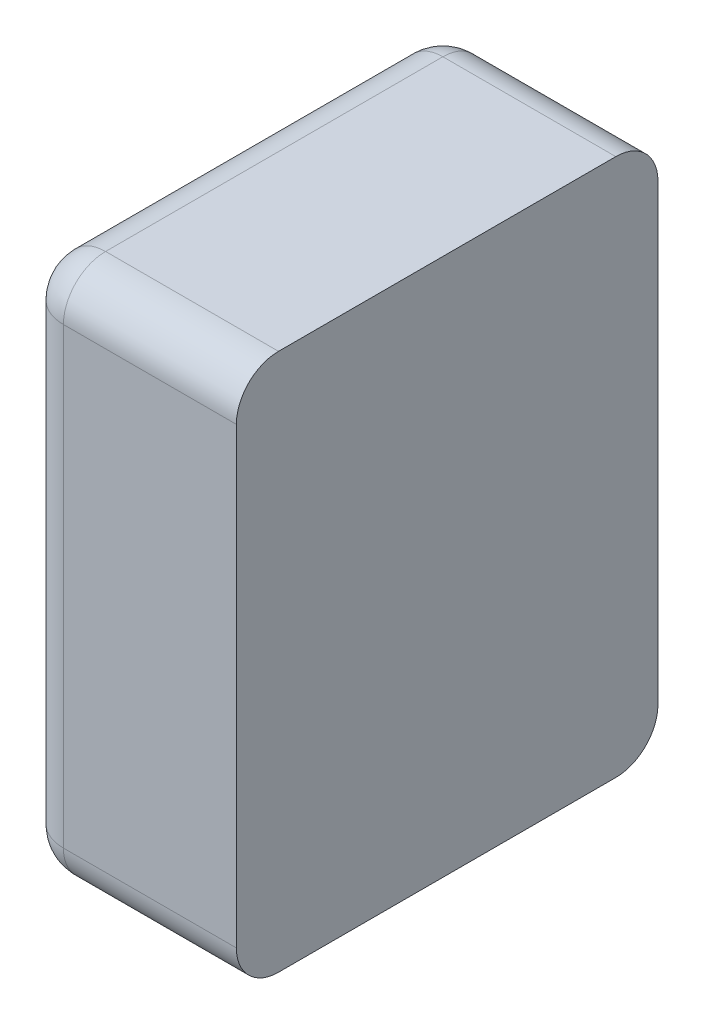
ISO-10303-21;
HEADER;
FILE_DESCRIPTION(('STEP AP214'),'2;1');
FILE_NAME('part.step','',(''),(''),'','','');
FILE_SCHEMA(('AUTOMOTIVE_DESIGN { 1 0 10303 214 1 1 1 1 }'));
ENDSEC;
DATA;
#1=APPLICATION_CONTEXT('core data for automotive mechanical design processes');
#2=APPLICATION_PROTOCOL_DEFINITION('international standard','automotive_design',2000,#1);
#3=PRODUCT_CONTEXT('',#1,'mechanical');
#4=PRODUCT('Part','Part','',(#3));
#5=PRODUCT_RELATED_PRODUCT_CATEGORY('part','',(#4));
#6=PRODUCT_DEFINITION_FORMATION('','',#4);
#7=PRODUCT_DEFINITION_CONTEXT('part definition',#1,'design');
#8=PRODUCT_DEFINITION('design','',#6,#7);
#9=PRODUCT_DEFINITION_SHAPE('','',#8);
#10=(LENGTH_UNIT() NAMED_UNIT(*) SI_UNIT(.MILLI.,.METRE.));
#11=(NAMED_UNIT(*) PLANE_ANGLE_UNIT() SI_UNIT($,.RADIAN.));
#12=(NAMED_UNIT(*) SI_UNIT($,.STERADIAN.) SOLID_ANGLE_UNIT());
#13=UNCERTAINTY_MEASURE_WITH_UNIT(LENGTH_MEASURE(1.E-05),#10,'distance_accuracy_value','');
#14=(GEOMETRIC_REPRESENTATION_CONTEXT(3) GLOBAL_UNCERTAINTY_ASSIGNED_CONTEXT((#13)) GLOBAL_UNIT_ASSIGNED_CONTEXT((#10,
#11,#12)) REPRESENTATION_CONTEXT('',''));
#15=CARTESIAN_POINT('',(0.,0.,0.));
#16=DIRECTION('',(0.,0.,1.));
#17=DIRECTION('',(1.,0.,0.));
#18=AXIS2_PLACEMENT_3D('',#15,#16,#17);
#19=CARTESIAN_POINT('',(-1.,-0.625,0.));
#20=DIRECTION('',(1.,0.,0.));
#21=DIRECTION('',(0.,0.,1.));
#22=AXIS2_PLACEMENT_3D('',#19,#20,#21);
#23=PLANE('',#22);
#24=DIRECTION('',(0.,1.,0.));
#25=VECTOR('',#24,1.);
#26=CARTESIAN_POINT('',(-1.,-0.625,0.882));
#27=LINE('',#26,#25);
#28=CARTESIAN_POINT('',(-1.,-0.527,0.882));
#29=VERTEX_POINT('',#28);
#30=CARTESIAN_POINT('',(-1.,0.527,0.882));
#31=VERTEX_POINT('',#30);
#32=EDGE_CURVE('E11',#29,#31,#27,.T.);
#33=ORIENTED_EDGE('',*,*,#32,.T.);
#34=DIRECTION('',(0.,0.,1.));
#35=VECTOR('',#34,1.);
#36=CARTESIAN_POINT('',(-1.,0.527,0.));
#37=LINE('',#36,#35);
#38=CARTESIAN_POINT('',(-1.,0.527,0.098));
#39=VERTEX_POINT('',#38);
#40=EDGE_CURVE('E24',#39,#31,#37,.T.);
#41=ORIENTED_EDGE('',*,*,#40,.F.);
#42=DIRECTION('',(0.,1.,0.));
#43=VECTOR('',#42,1.);
#44=CARTESIAN_POINT('',(-1.,-0.625,0.098));
#45=LINE('',#44,#43);
#46=CARTESIAN_POINT('',(-1.,-0.527,0.098));
#47=VERTEX_POINT('',#46);
#48=EDGE_CURVE('E192',#47,#39,#45,.T.);
#49=ORIENTED_EDGE('',*,*,#48,.F.);
#50=DIRECTION('',(0.,0.,1.));
#51=VECTOR('',#50,1.);
#52=CARTESIAN_POINT('',(-1.,-0.527,0.));
#53=LINE('',#52,#51);
#54=EDGE_CURVE('E36',#47,#29,#53,.T.);
#55=ORIENTED_EDGE('',*,*,#54,.T.);
#56=EDGE_LOOP('',(#33,#41,#49,#55));
#57=FACE_BOUND('',#56,.T.);
#58=ADVANCED_FACE('F17',(#57),#23,.F.);
#59=CARTESIAN_POINT('',(-0.902,-0.527,0.));
#60=DIRECTION('',(0.,0.,1.));
#61=DIRECTION('',(-1.,0.,0.));
#62=AXIS2_PLACEMENT_3D('',#59,#60,#61);
#63=CYLINDRICAL_SURFACE('',#62,0.098);
#64=ORIENTED_EDGE('',*,*,#54,.F.);
#65=CARTESIAN_POINT('',(-0.902,-0.527,0.098));
#66=DIRECTION('',(0.,0.,1.));
#67=DIRECTION('',(-1.,0.,0.));
#68=AXIS2_PLACEMENT_3D('',#65,#66,#67);
#69=CIRCLE('',#68,0.098);
#70=CARTESIAN_POINT('',(-0.902,-0.625,0.098));
#71=VERTEX_POINT('',#70);
#72=EDGE_CURVE('E189',#47,#71,#69,.T.);
#73=ORIENTED_EDGE('',*,*,#72,.T.);
#74=DIRECTION('',(0.,0.,1.));
#75=VECTOR('',#74,1.);
#76=CARTESIAN_POINT('',(-0.902,-0.625,0.));
#77=LINE('',#76,#75);
#78=CARTESIAN_POINT('',(-0.902,-0.625,0.882));
#79=VERTEX_POINT('',#78);
#80=EDGE_CURVE('E187',#71,#79,#77,.T.);
#81=ORIENTED_EDGE('',*,*,#80,.T.);
#82=CARTESIAN_POINT('',(-0.902,-0.527,0.882));
#83=DIRECTION('',(0.,0.,1.));
#84=DIRECTION('',(-1.,0.,0.));
#85=AXIS2_PLACEMENT_3D('',#82,#83,#84);
#86=CIRCLE('',#85,0.098);
#87=EDGE_CURVE('E184',#29,#79,#86,.T.);
#88=ORIENTED_EDGE('',*,*,#87,.F.);
#89=EDGE_LOOP('',(#64,#73,#81,#88));
#90=FACE_BOUND('',#89,.T.);
#91=ADVANCED_FACE('F238',(#90),#63,.T.);
#92=CARTESIAN_POINT('',(-0.902,-0.625,0.098));
#93=DIRECTION('',(0.,1.,0.));
#94=DIRECTION('',(-1.,0.,0.));
#95=AXIS2_PLACEMENT_3D('',#92,#93,#94);
#96=CYLINDRICAL_SURFACE('',#95,0.098);
#97=ORIENTED_EDGE('',*,*,#48,.T.);
#98=CARTESIAN_POINT('',(-0.902,0.527,0.098));
#99=DIRECTION('',(0.,1.,0.));
#100=DIRECTION('',(-1.,0.,0.));
#101=AXIS2_PLACEMENT_3D('',#98,#99,#100);
#102=CIRCLE('',#101,0.098);
#103=CARTESIAN_POINT('',(-0.902,0.527,0.));
#104=VERTEX_POINT('',#103);
#105=EDGE_CURVE('E181',#104,#39,#102,.T.);
#106=ORIENTED_EDGE('',*,*,#105,.F.);
#107=DIRECTION('',(0.,1.,0.));
#108=VECTOR('',#107,1.);
#109=CARTESIAN_POINT('',(-0.902,-0.625,0.));
#110=LINE('',#109,#108);
#111=CARTESIAN_POINT('',(-0.902,-0.527,0.));
#112=VERTEX_POINT('',#111);
#113=EDGE_CURVE('E178',#112,#104,#110,.T.);
#114=ORIENTED_EDGE('',*,*,#113,.F.);
#115=CARTESIAN_POINT('',(-0.902,-0.527,0.098));
#116=DIRECTION('',(0.,1.,0.));
#117=DIRECTION('',(-1.,0.,0.));
#118=AXIS2_PLACEMENT_3D('',#115,#116,#117);
#119=CIRCLE('',#118,0.098);
#120=EDGE_CURVE('E175',#112,#47,#119,.T.);
#121=ORIENTED_EDGE('',*,*,#120,.T.);
#122=EDGE_LOOP('',(#97,#106,#114,#121));
#123=FACE_BOUND('',#122,.T.);
#124=ADVANCED_FACE('F194',(#123),#96,.T.);
#125=CARTESIAN_POINT('',(-0.902,-0.625,0.882));
#126=DIRECTION('',(0.,1.,0.));
#127=DIRECTION('',(-1.,0.,0.));
#128=AXIS2_PLACEMENT_3D('',#125,#126,#127);
#129=CYLINDRICAL_SURFACE('',#128,0.098);
#130=CARTESIAN_POINT('',(-0.902,-0.527,0.882));
#131=DIRECTION('',(0.,-1.,0.));
#132=DIRECTION('',(-1.,0.,0.));
#133=AXIS2_PLACEMENT_3D('',#130,#131,#132);
#134=CIRCLE('',#133,0.098);
#135=CARTESIAN_POINT('',(-0.902,-0.527,0.98));
#136=VERTEX_POINT('',#135);
#137=EDGE_CURVE('E172',#136,#29,#134,.T.);
#138=ORIENTED_EDGE('',*,*,#137,.F.);
#139=DIRECTION('',(0.,1.,0.));
#140=VECTOR('',#139,1.);
#141=CARTESIAN_POINT('',(-0.902,-0.625,0.98));
#142=LINE('',#141,#140);
#143=CARTESIAN_POINT('',(-0.902,0.527,0.98));
#144=VERTEX_POINT('',#143);
#145=EDGE_CURVE('E170',#136,#144,#142,.T.);
#146=ORIENTED_EDGE('',*,*,#145,.T.);
#147=CARTESIAN_POINT('',(-0.902,0.527,0.882));
#148=DIRECTION('',(0.,1.,0.));
#149=DIRECTION('',(-1.,0.,0.));
#150=AXIS2_PLACEMENT_3D('',#147,#148,#149);
#151=CIRCLE('',#150,0.098);
#152=EDGE_CURVE('E167',#31,#144,#151,.T.);
#153=ORIENTED_EDGE('',*,*,#152,.F.);
#154=ORIENTED_EDGE('',*,*,#32,.F.);
#155=EDGE_LOOP('',(#138,#146,#153,#154));
#156=FACE_BOUND('',#155,.T.);
#157=ADVANCED_FACE('F246',(#156),#129,.T.);
#158=CARTESIAN_POINT('',(-0.902,0.527,0.));
#159=DIRECTION('',(0.,0.,1.));
#160=DIRECTION('',(-1.,0.,0.));
#161=AXIS2_PLACEMENT_3D('',#158,#159,#160);
#162=CYLINDRICAL_SURFACE('',#161,0.098);
#163=CARTESIAN_POINT('',(-0.902,0.527,0.882));
#164=DIRECTION('',(0.,0.,1.));
#165=DIRECTION('',(-1.,0.,0.));
#166=AXIS2_PLACEMENT_3D('',#163,#164,#165);
#167=CIRCLE('',#166,0.098);
#168=CARTESIAN_POINT('',(-0.902,0.625,0.882));
#169=VERTEX_POINT('',#168);
#170=EDGE_CURVE('E164',#169,#31,#167,.T.);
#171=ORIENTED_EDGE('',*,*,#170,.F.);
#172=DIRECTION('',(0.,0.,1.));
#173=VECTOR('',#172,1.);
#174=CARTESIAN_POINT('',(-0.902,0.625,0.));
#175=LINE('',#174,#173);
#176=CARTESIAN_POINT('',(-0.902,0.625,0.098));
#177=VERTEX_POINT('',#176);
#178=EDGE_CURVE('E109',#177,#169,#175,.T.);
#179=ORIENTED_EDGE('',*,*,#178,.F.);
#180=CARTESIAN_POINT('',(-0.902,0.527,0.098));
#181=DIRECTION('',(0.,0.,-1.));
#182=DIRECTION('',(-1.,0.,0.));
#183=AXIS2_PLACEMENT_3D('',#180,#181,#182);
#184=CIRCLE('',#183,0.098);
#185=EDGE_CURVE('E160',#39,#177,#184,.T.);
#186=ORIENTED_EDGE('',*,*,#185,.F.);
#187=ORIENTED_EDGE('',*,*,#40,.T.);
#188=EDGE_LOOP('',(#171,#179,#186,#187));
#189=FACE_BOUND('',#188,.T.);
#190=ADVANCED_FACE('F201',(#189),#162,.T.);
#191=CARTESIAN_POINT('',(-0.902,-0.527,0.098));
#192=DIRECTION('',(0.,0.,1.));
#193=DIRECTION('',(-1.,0.,0.));
#194=AXIS2_PLACEMENT_3D('',#191,#192,#193);
#195=SPHERICAL_SURFACE('',#194,0.098);
#196=ORIENTED_EDGE('',*,*,#120,.F.);
#197=CARTESIAN_POINT('',(-0.902,-0.527,0.098));
#198=DIRECTION('',(-1.,0.,0.));
#199=DIRECTION('',(0.,-1.,0.));
#200=AXIS2_PLACEMENT_3D('',#197,#198,#199);
#201=CIRCLE('',#200,0.098);
#202=EDGE_CURVE('E157',#112,#71,#201,.T.);
#203=ORIENTED_EDGE('',*,*,#202,.T.);
#204=ORIENTED_EDGE('',*,*,#72,.F.);
#205=EDGE_LOOP('',(#196,#203,#204));
#206=FACE_BOUND('',#205,.T.);
#207=ADVANCED_FACE('F253',(#206),#195,.T.);
#208=CARTESIAN_POINT('',(-0.902,-0.527,0.882));
#209=DIRECTION('',(0.,0.,-1.));
#210=DIRECTION('',(-1.,0.,0.));
#211=AXIS2_PLACEMENT_3D('',#208,#209,#210);
#212=SPHERICAL_SURFACE('',#211,0.098);
#213=ORIENTED_EDGE('',*,*,#87,.T.);
#214=CARTESIAN_POINT('',(-0.902,-0.527,0.882));
#215=DIRECTION('',(1.,0.,0.));
#216=DIRECTION('',(0.,-1.,0.));
#217=AXIS2_PLACEMENT_3D('',#214,#215,#216);
#218=CIRCLE('',#217,0.098);
#219=EDGE_CURVE('E154',#136,#79,#218,.T.);
#220=ORIENTED_EDGE('',*,*,#219,.F.);
#221=ORIENTED_EDGE('',*,*,#137,.T.);
#222=EDGE_LOOP('',(#213,#220,#221));
#223=FACE_BOUND('',#222,.T.);
#224=ADVANCED_FACE('F256',(#223),#212,.T.);
#225=CARTESIAN_POINT('',(-1.,-0.625,0.));
#226=DIRECTION('',(0.,1.,0.));
#227=DIRECTION('',(0.,0.,1.));
#228=AXIS2_PLACEMENT_3D('',#225,#226,#227);
#229=PLANE('',#228);
#230=DIRECTION('',(1.,0.,0.));
#231=VECTOR('',#230,1.);
#232=CARTESIAN_POINT('',(-1.,-0.625,0.882));
#233=LINE('',#232,#231);
#234=CARTESIAN_POINT('',(-0.5,-0.625,0.882));
#235=VERTEX_POINT('',#234);
#236=EDGE_CURVE('E151',#79,#235,#233,.T.);
#237=ORIENTED_EDGE('',*,*,#236,.F.);
#238=ORIENTED_EDGE('',*,*,#80,.F.);
#239=DIRECTION('',(1.,0.,0.));
#240=VECTOR('',#239,1.);
#241=CARTESIAN_POINT('',(-1.,-0.625,0.098));
#242=LINE('',#241,#240);
#243=CARTESIAN_POINT('',(-0.5,-0.625,0.098));
#244=VERTEX_POINT('',#243);
#245=EDGE_CURVE('E148',#71,#244,#242,.T.);
#246=ORIENTED_EDGE('',*,*,#245,.T.);
#247=DIRECTION('',(0.,0.,1.));
#248=VECTOR('',#247,1.);
#249=CARTESIAN_POINT('',(-0.5,-0.625,0.));
#250=LINE('',#249,#248);
#251=EDGE_CURVE('E146',#244,#235,#250,.T.);
#252=ORIENTED_EDGE('',*,*,#251,.T.);
#253=EDGE_LOOP('',(#237,#238,#246,#252));
#254=FACE_BOUND('',#253,.T.);
#255=ADVANCED_FACE('F216',(#254),#229,.F.);
#256=CARTESIAN_POINT('',(-1.,-0.625,0.));
#257=DIRECTION('',(0.,0.,1.));
#258=DIRECTION('',(1.,0.,0.));
#259=AXIS2_PLACEMENT_3D('',#256,#257,#258);
#260=PLANE('',#259);
#261=DIRECTION('',(1.,0.,0.));
#262=VECTOR('',#261,1.);
#263=CARTESIAN_POINT('',(-1.,-0.527,0.));
#264=LINE('',#263,#262);
#265=CARTESIAN_POINT('',(-0.5,-0.527,0.));
#266=VERTEX_POINT('',#265);
#267=EDGE_CURVE('E143',#112,#266,#264,.T.);
#268=ORIENTED_EDGE('',*,*,#267,.F.);
#269=ORIENTED_EDGE('',*,*,#113,.T.);
#270=DIRECTION('',(1.,0.,0.));
#271=VECTOR('',#270,1.);
#272=CARTESIAN_POINT('',(-1.,0.527,0.));
#273=LINE('',#272,#271);
#274=CARTESIAN_POINT('',(-0.5,0.527,0.));
#275=VERTEX_POINT('',#274);
#276=EDGE_CURVE('E140',#104,#275,#273,.T.);
#277=ORIENTED_EDGE('',*,*,#276,.T.);
#278=DIRECTION('',(0.,1.,0.));
#279=VECTOR('',#278,1.);
#280=CARTESIAN_POINT('',(-0.5,-0.625,0.));
#281=LINE('',#280,#279);
#282=EDGE_CURVE('E138',#266,#275,#281,.T.);
#283=ORIENTED_EDGE('',*,*,#282,.F.);
#284=EDGE_LOOP('',(#268,#269,#277,#283));
#285=FACE_BOUND('',#284,.T.);
#286=ADVANCED_FACE('F225',(#285),#260,.F.);
#287=CARTESIAN_POINT('',(-0.902,0.527,0.098));
#288=DIRECTION('',(0.,0.,1.));
#289=DIRECTION('',(-1.,0.,0.));
#290=AXIS2_PLACEMENT_3D('',#287,#288,#289);
#291=SPHERICAL_SURFACE('',#290,0.098);
#292=ORIENTED_EDGE('',*,*,#185,.T.);
#293=CARTESIAN_POINT('',(-0.902,0.527,0.098));
#294=DIRECTION('',(1.,0.,0.));
#295=DIRECTION('',(0.,1.,0.));
#296=AXIS2_PLACEMENT_3D('',#293,#294,#295);
#297=CIRCLE('',#296,0.098);
#298=EDGE_CURVE('E135',#104,#177,#297,.T.);
#299=ORIENTED_EDGE('',*,*,#298,.F.);
#300=ORIENTED_EDGE('',*,*,#105,.T.);
#301=EDGE_LOOP('',(#292,#299,#300));
#302=FACE_BOUND('',#301,.T.);
#303=ADVANCED_FACE('F200',(#302),#291,.T.);
#304=CARTESIAN_POINT('',(-1.,-0.625,0.98));
#305=DIRECTION('',(0.,0.,1.));
#306=DIRECTION('',(1.,0.,0.));
#307=AXIS2_PLACEMENT_3D('',#304,#305,#306);
#308=PLANE('',#307);
#309=DIRECTION('',(0.,1.,0.));
#310=VECTOR('',#309,1.);
#311=CARTESIAN_POINT('',(-0.5,-0.625,0.98));
#312=LINE('',#311,#310);
#313=CARTESIAN_POINT('',(-0.5,-0.527,0.98));
#314=VERTEX_POINT('',#313);
#315=CARTESIAN_POINT('',(-0.5,0.527,0.98));
#316=VERTEX_POINT('',#315);
#317=EDGE_CURVE('E133',#314,#316,#312,.T.);
#318=ORIENTED_EDGE('',*,*,#317,.T.);
#319=DIRECTION('',(1.,0.,0.));
#320=VECTOR('',#319,1.);
#321=CARTESIAN_POINT('',(-1.,0.527,0.98));
#322=LINE('',#321,#320);
#323=EDGE_CURVE('E118',#144,#316,#322,.T.);
#324=ORIENTED_EDGE('',*,*,#323,.F.);
#325=ORIENTED_EDGE('',*,*,#145,.F.);
#326=DIRECTION('',(1.,0.,0.));
#327=VECTOR('',#326,1.);
#328=CARTESIAN_POINT('',(-1.,-0.527,0.98));
#329=LINE('',#328,#327);
#330=EDGE_CURVE('E129',#136,#314,#329,.T.);
#331=ORIENTED_EDGE('',*,*,#330,.T.);
#332=EDGE_LOOP('',(#318,#324,#325,#331));
#333=FACE_BOUND('',#332,.T.);
#334=ADVANCED_FACE('F207',(#333),#308,.T.);
#335=CARTESIAN_POINT('',(-0.902,0.527,0.882));
#336=DIRECTION('',(0.,-1.,0.));
#337=DIRECTION('',(-1.,0.,0.));
#338=AXIS2_PLACEMENT_3D('',#335,#336,#337);
#339=SPHERICAL_SURFACE('',#338,0.098);
#340=ORIENTED_EDGE('',*,*,#152,.T.);
#341=CARTESIAN_POINT('',(-0.902,0.527,0.882));
#342=DIRECTION('',(1.,0.,0.));
#343=DIRECTION('',(0.,0.,1.));
#344=AXIS2_PLACEMENT_3D('',#341,#342,#343);
#345=CIRCLE('',#344,0.098);
#346=EDGE_CURVE('E102',#169,#144,#345,.T.);
#347=ORIENTED_EDGE('',*,*,#346,.F.);
#348=ORIENTED_EDGE('',*,*,#170,.T.);
#349=EDGE_LOOP('',(#340,#347,#348));
#350=FACE_BOUND('',#349,.T.);
#351=ADVANCED_FACE('F203',(#350),#339,.T.);
#352=CARTESIAN_POINT('',(-1.,0.625,0.));
#353=DIRECTION('',(0.,1.,0.));
#354=DIRECTION('',(0.,0.,1.));
#355=AXIS2_PLACEMENT_3D('',#352,#353,#354);
#356=PLANE('',#355);
#357=DIRECTION('',(0.,0.,1.));
#358=VECTOR('',#357,1.);
#359=CARTESIAN_POINT('',(-0.5,0.625,0.));
#360=LINE('',#359,#358);
#361=CARTESIAN_POINT('',(-0.5,0.625,0.098));
#362=VERTEX_POINT('',#361);
#363=CARTESIAN_POINT('',(-0.5,0.625,0.882));
#364=VERTEX_POINT('',#363);
#365=EDGE_CURVE('E92',#362,#364,#360,.T.);
#366=ORIENTED_EDGE('',*,*,#365,.F.);
#367=DIRECTION('',(1.,0.,0.));
#368=VECTOR('',#367,1.);
#369=CARTESIAN_POINT('',(-1.,0.625,0.098));
#370=LINE('',#369,#368);
#371=EDGE_CURVE('E103',#177,#362,#370,.T.);
#372=ORIENTED_EDGE('',*,*,#371,.F.);
#373=ORIENTED_EDGE('',*,*,#178,.T.);
#374=DIRECTION('',(1.,0.,0.));
#375=VECTOR('',#374,1.);
#376=CARTESIAN_POINT('',(-1.,0.625,0.882));
#377=LINE('',#376,#375);
#378=EDGE_CURVE('E107',#169,#364,#377,.T.);
#379=ORIENTED_EDGE('',*,*,#378,.T.);
#380=EDGE_LOOP('',(#366,#372,#373,#379));
#381=FACE_BOUND('',#380,.T.);
#382=ADVANCED_FACE('F108',(#381),#356,.T.);
#383=CARTESIAN_POINT('',(-1.,-0.527,0.098));
#384=DIRECTION('',(1.,0.,0.));
#385=DIRECTION('',(0.,-1.,0.));
#386=AXIS2_PLACEMENT_3D('',#383,#384,#385);
#387=CYLINDRICAL_SURFACE('',#386,0.098);
#388=ORIENTED_EDGE('',*,*,#202,.F.);
#389=ORIENTED_EDGE('',*,*,#267,.T.);
#390=CARTESIAN_POINT('',(-0.5,-0.527,0.098));
#391=DIRECTION('',(1.,0.,0.));
#392=DIRECTION('',(0.,0.,1.));
#393=AXIS2_PLACEMENT_3D('',#390,#391,#392);
#394=CIRCLE('',#393,0.098);
#395=EDGE_CURVE('E113',#244,#266,#394,.T.);
#396=ORIENTED_EDGE('',*,*,#395,.F.);
#397=ORIENTED_EDGE('',*,*,#245,.F.);
#398=EDGE_LOOP('',(#388,#389,#396,#397));
#399=FACE_BOUND('',#398,.T.);
#400=ADVANCED_FACE('F221',(#399),#387,.T.);
#401=CARTESIAN_POINT('',(-1.,-0.527,0.882));
#402=DIRECTION('',(1.,0.,0.));
#403=DIRECTION('',(0.,-1.,0.));
#404=AXIS2_PLACEMENT_3D('',#401,#402,#403);
#405=CYLINDRICAL_SURFACE('',#404,0.098);
#406=ORIENTED_EDGE('',*,*,#236,.T.);
#407=CARTESIAN_POINT('',(-0.5,-0.527,0.882));
#408=DIRECTION('',(-1.,0.,0.));
#409=DIRECTION('',(0.,0.,1.));
#410=AXIS2_PLACEMENT_3D('',#407,#408,#409);
#411=CIRCLE('',#410,0.098);
#412=EDGE_CURVE('E120',#235,#314,#411,.T.);
#413=ORIENTED_EDGE('',*,*,#412,.T.);
#414=ORIENTED_EDGE('',*,*,#330,.F.);
#415=ORIENTED_EDGE('',*,*,#219,.T.);
#416=EDGE_LOOP('',(#406,#413,#414,#415));
#417=FACE_BOUND('',#416,.T.);
#418=ADVANCED_FACE('F212',(#417),#405,.T.);
#419=CARTESIAN_POINT('',(-0.5,-0.625,0.));
#420=DIRECTION('',(1.,0.,0.));
#421=DIRECTION('',(0.,0.,1.));
#422=AXIS2_PLACEMENT_3D('',#419,#420,#421);
#423=PLANE('',#422);
#424=ORIENTED_EDGE('',*,*,#251,.F.);
#425=ORIENTED_EDGE('',*,*,#395,.T.);
#426=ORIENTED_EDGE('',*,*,#282,.T.);
#427=CARTESIAN_POINT('',(-0.5,0.527,0.098));
#428=DIRECTION('',(-1.,0.,0.));
#429=DIRECTION('',(0.,0.,1.));
#430=AXIS2_PLACEMENT_3D('',#427,#428,#429);
#431=CIRCLE('',#430,0.098);
#432=EDGE_CURVE('E98',#362,#275,#431,.T.);
#433=ORIENTED_EDGE('',*,*,#432,.F.);
#434=ORIENTED_EDGE('',*,*,#365,.T.);
#435=CARTESIAN_POINT('',(-0.5,0.527,0.882));
#436=DIRECTION('',(1.,0.,0.));
#437=DIRECTION('',(0.,0.,1.));
#438=AXIS2_PLACEMENT_3D('',#435,#436,#437);
#439=CIRCLE('',#438,0.098);
#440=EDGE_CURVE('E96',#364,#316,#439,.T.);
#441=ORIENTED_EDGE('',*,*,#440,.T.);
#442=ORIENTED_EDGE('',*,*,#317,.F.);
#443=ORIENTED_EDGE('',*,*,#412,.F.);
#444=EDGE_LOOP('',(#424,#425,#426,#433,#434,#441,#442,#443));
#445=FACE_BOUND('',#444,.T.);
#446=ADVANCED_FACE('F94',(#445),#423,.T.);
#447=CARTESIAN_POINT('',(-1.,0.527,0.098));
#448=DIRECTION('',(1.,0.,0.));
#449=DIRECTION('',(0.,1.,0.));
#450=AXIS2_PLACEMENT_3D('',#447,#448,#449);
#451=CYLINDRICAL_SURFACE('',#450,0.098);
#452=ORIENTED_EDGE('',*,*,#371,.T.);
#453=ORIENTED_EDGE('',*,*,#432,.T.);
#454=ORIENTED_EDGE('',*,*,#276,.F.);
#455=ORIENTED_EDGE('',*,*,#298,.T.);
#456=EDGE_LOOP('',(#452,#453,#454,#455));
#457=FACE_BOUND('',#456,.T.);
#458=ADVANCED_FACE('F227',(#457),#451,.T.);
#459=CARTESIAN_POINT('',(-1.,0.527,0.882));
#460=DIRECTION('',(1.,0.,0.));
#461=DIRECTION('',(0.,1.,0.));
#462=AXIS2_PLACEMENT_3D('',#459,#460,#461);
#463=CYLINDRICAL_SURFACE('',#462,0.098);
#464=ORIENTED_EDGE('',*,*,#346,.T.);
#465=ORIENTED_EDGE('',*,*,#323,.T.);
#466=ORIENTED_EDGE('',*,*,#440,.F.);
#467=ORIENTED_EDGE('',*,*,#378,.F.);
#468=EDGE_LOOP('',(#464,#465,#466,#467));
#469=FACE_BOUND('',#468,.T.);
#470=ADVANCED_FACE('F116',(#469),#463,.T.);
#471=CLOSED_SHELL('',(#58,#91,#124,#157,#190,#207,#224,#255,#286,#303,#334,#351,#382,#400,#418,
#446,#458,#470));
#472=MANIFOLD_SOLID_BREP('B1',#471);
#473=ADVANCED_BREP_SHAPE_REPRESENTATION('',(#18,#472),#14);
#474=SHAPE_DEFINITION_REPRESENTATION(#9,#473);
ENDSEC;
END-ISO-10303-21;
